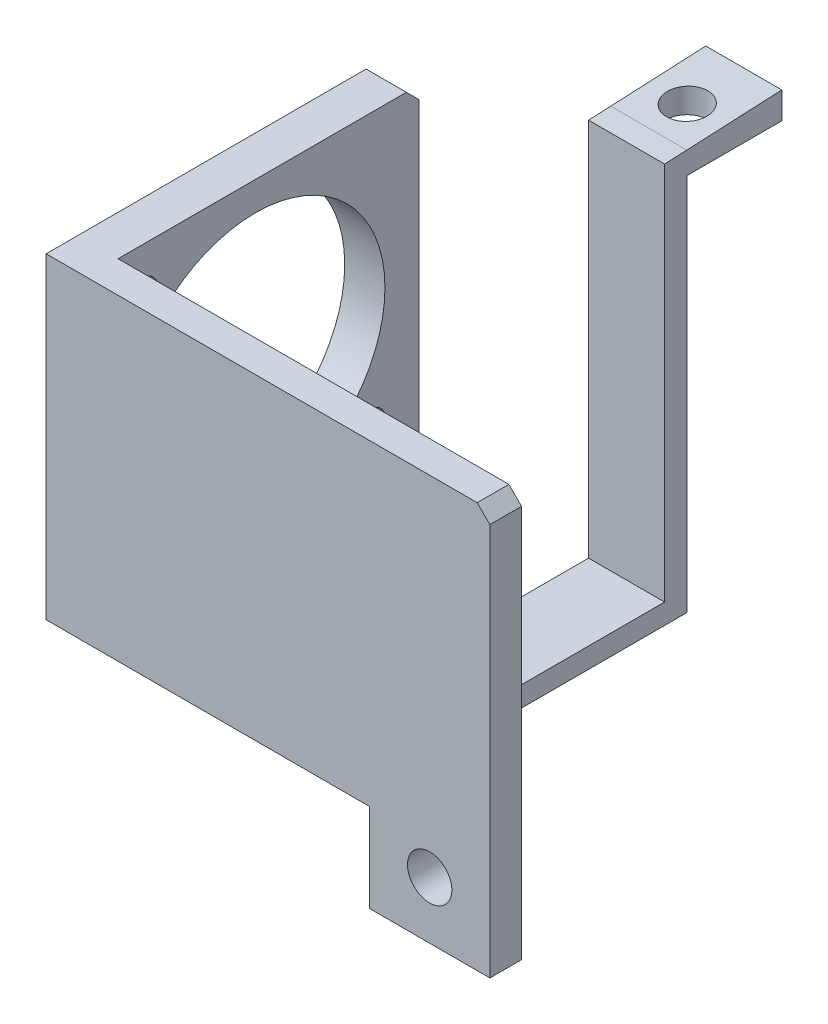
ISO-10303-21;
HEADER;
FILE_DESCRIPTION(('STEP AP214'),'2;1');
FILE_NAME('part.step','',(''),(''),'','','');
FILE_SCHEMA(('AUTOMOTIVE_DESIGN { 1 0 10303 214 1 1 1 1 }'));
ENDSEC;
DATA;
#1=APPLICATION_CONTEXT('core data for automotive mechanical design processes');
#2=APPLICATION_PROTOCOL_DEFINITION('international standard','automotive_design',2000,#1);
#3=PRODUCT_CONTEXT('',#1,'mechanical');
#4=PRODUCT('Part','Part','',(#3));
#5=PRODUCT_RELATED_PRODUCT_CATEGORY('part','',(#4));
#6=PRODUCT_DEFINITION_FORMATION('','',#4);
#7=PRODUCT_DEFINITION_CONTEXT('part definition',#1,'design');
#8=PRODUCT_DEFINITION('design','',#6,#7);
#9=PRODUCT_DEFINITION_SHAPE('','',#8);
#10=(LENGTH_UNIT() NAMED_UNIT(*) SI_UNIT(.MILLI.,.METRE.));
#11=(NAMED_UNIT(*) PLANE_ANGLE_UNIT() SI_UNIT($,.RADIAN.));
#12=(NAMED_UNIT(*) SI_UNIT($,.STERADIAN.) SOLID_ANGLE_UNIT());
#13=UNCERTAINTY_MEASURE_WITH_UNIT(LENGTH_MEASURE(1.E-05),#10,'distance_accuracy_value','');
#14=(GEOMETRIC_REPRESENTATION_CONTEXT(3) GLOBAL_UNCERTAINTY_ASSIGNED_CONTEXT((#13)) GLOBAL_UNIT_ASSIGNED_CONTEXT((#10,
#11,#12)) REPRESENTATION_CONTEXT('',''));
#15=CARTESIAN_POINT('',(0.,0.,0.));
#16=DIRECTION('',(0.,0.,1.));
#17=DIRECTION('',(1.,0.,0.));
#18=AXIS2_PLACEMENT_3D('',#15,#16,#17);
#19=CARTESIAN_POINT('',(0.,0.,-46.5));
#20=DIRECTION('',(0.,0.,1.));
#21=DIRECTION('',(1.,0.,0.));
#22=AXIS2_PLACEMENT_3D('',#19,#20,#21);
#23=PLANE('',#22);
#24=DIRECTION('',(-1.,0.,0.));
#25=VECTOR('',#24,1.);
#26=CARTESIAN_POINT('',(49.56,59.6966428528848,-46.5));
#27=LINE('',#26,#25);
#28=CARTESIAN_POINT('',(49.56,59.6966428528848,-46.5));
#29=VERTEX_POINT('',#28);
#30=CARTESIAN_POINT('',(37.56,59.6966428528848,-46.5));
#31=VERTEX_POINT('',#30);
#32=EDGE_CURVE('E483',#29,#31,#27,.T.);
#33=ORIENTED_EDGE('',*,*,#32,.F.);
#34=DIRECTION('',(0.,-1.,0.));
#35=VECTOR('',#34,1.);
#36=CARTESIAN_POINT('',(49.56,0.,-46.5));
#37=LINE('',#36,#35);
#38=CARTESIAN_POINT('',(49.56,0.,-46.5));
#39=VERTEX_POINT('',#38);
#40=EDGE_CURVE('E217',#29,#39,#37,.T.);
#41=ORIENTED_EDGE('',*,*,#40,.T.);
#42=DIRECTION('',(-1.,0.,0.));
#43=VECTOR('',#42,1.);
#44=CARTESIAN_POINT('',(49.56,0.,-46.5));
#45=LINE('',#44,#43);
#46=CARTESIAN_POINT('',(37.56,0.,-46.5));
#47=VERTEX_POINT('',#46);
#48=EDGE_CURVE('E219',#39,#47,#45,.T.);
#49=ORIENTED_EDGE('',*,*,#48,.T.);
#50=DIRECTION('',(0.,1.,0.));
#51=VECTOR('',#50,1.);
#52=CARTESIAN_POINT('',(37.56,0.,-46.5));
#53=LINE('',#52,#51);
#54=EDGE_CURVE('E222',#47,#31,#53,.T.);
#55=ORIENTED_EDGE('',*,*,#54,.T.);
#56=EDGE_LOOP('',(#33,#41,#49,#55));
#57=FACE_BOUND('',#56,.T.);
#58=ADVANCED_FACE('F37',(#57),#23,.F.);
#59=CARTESIAN_POINT('',(49.56,3.2,-46.5));
#60=DIRECTION('',(0.,-1.,0.));
#61=DIRECTION('',(0.,0.,-1.));
#62=AXIS2_PLACEMENT_3D('',#59,#60,#61);
#63=PLANE('',#62);
#64=DIRECTION('',(1.,0.,0.));
#65=VECTOR('',#64,1.);
#66=CARTESIAN_POINT('',(37.56,3.2,-43.));
#67=LINE('',#66,#65);
#68=CARTESIAN_POINT('',(37.56,3.2,-43.));
#69=VERTEX_POINT('',#68);
#70=CARTESIAN_POINT('',(49.56,3.2,-43.));
#71=VERTEX_POINT('',#70);
#72=EDGE_CURVE('E213',#69,#71,#67,.T.);
#73=ORIENTED_EDGE('',*,*,#72,.F.);
#74=DIRECTION('',(0.,0.,1.));
#75=VECTOR('',#74,1.);
#76=CARTESIAN_POINT('',(37.56,3.2,-46.5));
#77=LINE('',#76,#75);
#78=CARTESIAN_POINT('',(37.56,3.2,0.));
#79=VERTEX_POINT('',#78);
#80=EDGE_CURVE('E234',#69,#79,#77,.T.);
#81=ORIENTED_EDGE('',*,*,#80,.T.);
#82=DIRECTION('',(1.,0.,0.));
#83=VECTOR('',#82,1.);
#84=CARTESIAN_POINT('',(49.56,3.2,0.));
#85=LINE('',#84,#83);
#86=CARTESIAN_POINT('',(49.56,3.2,0.));
#87=VERTEX_POINT('',#86);
#88=EDGE_CURVE('E220',#79,#87,#85,.T.);
#89=ORIENTED_EDGE('',*,*,#88,.T.);
#90=DIRECTION('',(0.,0.,1.));
#91=VECTOR('',#90,1.);
#92=CARTESIAN_POINT('',(49.56,3.2,-46.5));
#93=LINE('',#92,#91);
#94=EDGE_CURVE('E225',#71,#87,#93,.T.);
#95=ORIENTED_EDGE('',*,*,#94,.F.);
#96=EDGE_LOOP('',(#73,#81,#89,#95));
#97=FACE_BOUND('',#96,.T.);
#98=ADVANCED_FACE('F378',(#97),#63,.F.);
#99=CARTESIAN_POINT('',(0.,0.,0.));
#100=DIRECTION('',(0.,0.,-1.));
#101=DIRECTION('',(-1.,0.,0.));
#102=AXIS2_PLACEMENT_3D('',#99,#100,#101);
#103=PLANE('',#102);
#104=CARTESIAN_POINT('',(60.5,-4.93898511090854,0.));
#105=DIRECTION('',(0.,0.,-1.));
#106=DIRECTION('',(-1.,0.,0.));
#107=AXIS2_PLACEMENT_3D('',#104,#105,#106);
#108=CIRCLE('',#107,3.5);
#109=CARTESIAN_POINT('',(57.,-4.93898511090854,0.));
#110=VERTEX_POINT('',#109);
#111=EDGE_CURVE('E240',#110,#110,#108,.T.);
#112=ORIENTED_EDGE('',*,*,#111,.F.);
#113=EDGE_LOOP('',(#112));
#114=FACE_BOUND('',#113,.T.);
#115=DIRECTION('',(-1.,0.,0.));
#116=VECTOR('',#115,1.);
#117=CARTESIAN_POINT('',(0.,50.,0.));
#118=LINE('',#117,#116);
#119=CARTESIAN_POINT('',(68.,50.,0.));
#120=VERTEX_POINT('',#119);
#121=CARTESIAN_POINT('',(6.35,50.,0.));
#122=VERTEX_POINT('',#121);
#123=EDGE_CURVE('E283',#120,#122,#118,.T.);
#124=ORIENTED_EDGE('',*,*,#123,.F.);
#125=DIRECTION('',(-0.70710678118655,0.707106781186545,0.));
#126=VECTOR('',#125,1.);
#127=CARTESIAN_POINT('',(58.9999999999998,59.0000000000002,0.));
#128=LINE('',#127,#126);
#129=CARTESIAN_POINT('',(70.,48.,0.));
#130=VERTEX_POINT('',#129);
#131=EDGE_CURVE('E324',#120,#130,#128,.F.);
#132=ORIENTED_EDGE('',*,*,#131,.T.);
#133=DIRECTION('',(0.,1.,0.));
#134=VECTOR('',#133,1.);
#135=CARTESIAN_POINT('',(70.,64.0610148890915,0.));
#136=LINE('',#135,#134);
#137=CARTESIAN_POINT('',(70.,-13.9389851109085,0.));
#138=VERTEX_POINT('',#137);
#139=EDGE_CURVE('E302',#138,#130,#136,.T.);
#140=ORIENTED_EDGE('',*,*,#139,.F.);
#141=DIRECTION('',(1.,0.,0.));
#142=VECTOR('',#141,1.);
#143=CARTESIAN_POINT('',(70.,-13.9389851109085,0.));
#144=LINE('',#143,#142);
#145=CARTESIAN_POINT('',(51.,-13.9389851109085,0.));
#146=VERTEX_POINT('',#145);
#147=EDGE_CURVE('E300',#146,#138,#144,.T.);
#148=ORIENTED_EDGE('',*,*,#147,.F.);
#149=DIRECTION('',(0.,-1.,0.));
#150=VECTOR('',#149,1.);
#151=CARTESIAN_POINT('',(51.,-13.9389851109085,0.));
#152=LINE('',#151,#150);
#153=CARTESIAN_POINT('',(51.,0.,0.));
#154=VERTEX_POINT('',#153);
#155=EDGE_CURVE('E298',#154,#146,#152,.T.);
#156=ORIENTED_EDGE('',*,*,#155,.F.);
#157=DIRECTION('',(1.,0.,0.));
#158=VECTOR('',#157,1.);
#159=CARTESIAN_POINT('',(51.,0.,0.));
#160=LINE('',#159,#158);
#161=CARTESIAN_POINT('',(49.56,0.,0.));
#162=VERTEX_POINT('',#161);
#163=EDGE_CURVE('E278',#162,#154,#160,.T.);
#164=ORIENTED_EDGE('',*,*,#163,.F.);
#165=DIRECTION('',(0.,-1.,0.));
#166=VECTOR('',#165,1.);
#167=CARTESIAN_POINT('',(49.56,0.,0.));
#168=LINE('',#167,#166);
#169=EDGE_CURVE('E186',#87,#162,#168,.T.);
#170=ORIENTED_EDGE('',*,*,#169,.F.);
#171=ORIENTED_EDGE('',*,*,#88,.F.);
#172=DIRECTION('',(0.,1.,0.));
#173=VECTOR('',#172,1.);
#174=CARTESIAN_POINT('',(37.56,0.,0.));
#175=LINE('',#174,#173);
#176=CARTESIAN_POINT('',(37.56,0.,0.));
#177=VERTEX_POINT('',#176);
#178=EDGE_CURVE('E228',#177,#79,#175,.T.);
#179=ORIENTED_EDGE('',*,*,#178,.F.);
#180=CARTESIAN_POINT('',(6.35,0.,0.));
#181=VERTEX_POINT('',#180);
#182=EDGE_CURVE('E295',#181,#177,#160,.T.);
#183=ORIENTED_EDGE('',*,*,#182,.F.);
#184=DIRECTION('',(0.,-1.,0.));
#185=VECTOR('',#184,1.);
#186=CARTESIAN_POINT('',(6.35,0.,0.));
#187=LINE('',#186,#185);
#188=EDGE_CURVE('E270',#122,#181,#187,.T.);
#189=ORIENTED_EDGE('',*,*,#188,.F.);
#190=EDGE_LOOP('',(#124,#132,#140,#148,#156,#164,#170,#171,#179,#183,#189));
#191=FACE_BOUND('',#190,.T.);
#192=ADVANCED_FACE('F359',(#114,#191),#103,.T.);
#193=CARTESIAN_POINT('',(51.,0.,5.));
#194=DIRECTION('',(0.,1.,0.));
#195=DIRECTION('',(-1.,0.,0.));
#196=AXIS2_PLACEMENT_3D('',#193,#194,#195);
#197=PLANE('',#196);
#198=DIRECTION('',(0.,0.,-1.));
#199=VECTOR('',#198,1.);
#200=CARTESIAN_POINT('',(0.,0.,5.));
#201=LINE('',#200,#199);
#202=CARTESIAN_POINT('',(0.,0.,5.));
#203=VERTEX_POINT('',#202);
#204=CARTESIAN_POINT('',(0.,0.,-45.48));
#205=VERTEX_POINT('',#204);
#206=EDGE_CURVE('E294',#203,#205,#201,.T.);
#207=ORIENTED_EDGE('',*,*,#206,.T.);
#208=DIRECTION('',(1.,0.,0.));
#209=VECTOR('',#208,1.);
#210=CARTESIAN_POINT('',(51.,0.,-45.48));
#211=LINE('',#210,#209);
#212=CARTESIAN_POINT('',(6.35,0.,-45.48));
#213=VERTEX_POINT('',#212);
#214=EDGE_CURVE('E11',#205,#213,#211,.T.);
#215=ORIENTED_EDGE('',*,*,#214,.T.);
#216=DIRECTION('',(0.,0.,1.));
#217=VECTOR('',#216,1.);
#218=CARTESIAN_POINT('',(6.35,0.,-52.48));
#219=LINE('',#218,#217);
#220=EDGE_CURVE('E273',#213,#181,#219,.T.);
#221=ORIENTED_EDGE('',*,*,#220,.T.);
#222=ORIENTED_EDGE('',*,*,#182,.T.);
#223=DIRECTION('',(0.,0.,1.));
#224=VECTOR('',#223,1.);
#225=CARTESIAN_POINT('',(37.56,0.,-46.5));
#226=LINE('',#225,#224);
#227=EDGE_CURVE('E236',#47,#177,#226,.T.);
#228=ORIENTED_EDGE('',*,*,#227,.F.);
#229=ORIENTED_EDGE('',*,*,#48,.F.);
#230=DIRECTION('',(0.,0.,1.));
#231=VECTOR('',#230,1.);
#232=CARTESIAN_POINT('',(49.56,0.,-46.5));
#233=LINE('',#232,#231);
#234=EDGE_CURVE('E238',#39,#162,#233,.T.);
#235=ORIENTED_EDGE('',*,*,#234,.T.);
#236=ORIENTED_EDGE('',*,*,#163,.T.);
#237=DIRECTION('',(0.,0.,-1.));
#238=VECTOR('',#237,1.);
#239=CARTESIAN_POINT('',(51.,0.,5.));
#240=LINE('',#239,#238);
#241=CARTESIAN_POINT('',(51.,0.,5.));
#242=VERTEX_POINT('',#241);
#243=EDGE_CURVE('E316',#242,#154,#240,.T.);
#244=ORIENTED_EDGE('',*,*,#243,.F.);
#245=DIRECTION('',(1.,0.,0.));
#246=VECTOR('',#245,1.);
#247=CARTESIAN_POINT('',(51.,0.,5.));
#248=LINE('',#247,#246);
#249=EDGE_CURVE('E279',#203,#242,#248,.T.);
#250=ORIENTED_EDGE('',*,*,#249,.F.);
#251=EDGE_LOOP('',(#207,#215,#221,#222,#228,#229,#235,#236,#244,#250));
#252=FACE_BOUND('',#251,.T.);
#253=ADVANCED_FACE('F365',(#252),#197,.F.);
#254=CARTESIAN_POINT('',(51.,-13.9389851109085,5.));
#255=DIRECTION('',(1.,0.,0.));
#256=DIRECTION('',(0.,0.,-1.));
#257=AXIS2_PLACEMENT_3D('',#254,#255,#256);
#258=PLANE('',#257);
#259=ORIENTED_EDGE('',*,*,#155,.T.);
#260=DIRECTION('',(0.,0.,-1.));
#261=VECTOR('',#260,1.);
#262=CARTESIAN_POINT('',(51.,-13.9389851109085,5.));
#263=LINE('',#262,#261);
#264=CARTESIAN_POINT('',(51.,-13.9389851109085,5.));
#265=VERTEX_POINT('',#264);
#266=EDGE_CURVE('E313',#265,#146,#263,.T.);
#267=ORIENTED_EDGE('',*,*,#266,.F.);
#268=DIRECTION('',(0.,-1.,0.));
#269=VECTOR('',#268,1.);
#270=CARTESIAN_POINT('',(51.,-13.9389851109085,5.));
#271=LINE('',#270,#269);
#272=EDGE_CURVE('E282',#242,#265,#271,.T.);
#273=ORIENTED_EDGE('',*,*,#272,.F.);
#274=ORIENTED_EDGE('',*,*,#243,.T.);
#275=EDGE_LOOP('',(#259,#267,#273,#274));
#276=FACE_BOUND('',#275,.T.);
#277=ADVANCED_FACE('F437',(#276),#258,.F.);
#278=CARTESIAN_POINT('',(70.,-13.9389851109085,5.));
#279=DIRECTION('',(0.,1.,0.));
#280=DIRECTION('',(-1.,0.,0.));
#281=AXIS2_PLACEMENT_3D('',#278,#279,#280);
#282=PLANE('',#281);
#283=ORIENTED_EDGE('',*,*,#147,.T.);
#284=DIRECTION('',(0.,0.,-1.));
#285=VECTOR('',#284,1.);
#286=CARTESIAN_POINT('',(70.,-13.9389851109085,5.));
#287=LINE('',#286,#285);
#288=CARTESIAN_POINT('',(70.,-13.9389851109085,5.));
#289=VERTEX_POINT('',#288);
#290=EDGE_CURVE('E310',#289,#138,#287,.T.);
#291=ORIENTED_EDGE('',*,*,#290,.F.);
#292=DIRECTION('',(1.,0.,0.));
#293=VECTOR('',#292,1.);
#294=CARTESIAN_POINT('',(70.,-13.9389851109085,5.));
#295=LINE('',#294,#293);
#296=EDGE_CURVE('E285',#265,#289,#295,.T.);
#297=ORIENTED_EDGE('',*,*,#296,.F.);
#298=ORIENTED_EDGE('',*,*,#266,.T.);
#299=EDGE_LOOP('',(#283,#291,#297,#298));
#300=FACE_BOUND('',#299,.T.);
#301=ADVANCED_FACE('F433',(#300),#282,.F.);
#302=CARTESIAN_POINT('',(70.,64.0610148890915,5.));
#303=DIRECTION('',(-1.,0.,0.));
#304=DIRECTION('',(0.,-1.,0.));
#305=AXIS2_PLACEMENT_3D('',#302,#303,#304);
#306=PLANE('',#305);
#307=ORIENTED_EDGE('',*,*,#139,.T.);
#308=DIRECTION('',(0.,0.,1.));
#309=VECTOR('',#308,1.);
#310=CARTESIAN_POINT('',(70.,48.,5.));
#311=LINE('',#310,#309);
#312=CARTESIAN_POINT('',(70.,48.,5.));
#313=VERTEX_POINT('',#312);
#314=EDGE_CURVE('E326',#130,#313,#311,.T.);
#315=ORIENTED_EDGE('',*,*,#314,.T.);
#316=DIRECTION('',(0.,1.,0.));
#317=VECTOR('',#316,1.);
#318=CARTESIAN_POINT('',(70.,64.0610148890915,5.));
#319=LINE('',#318,#317);
#320=EDGE_CURVE('E287',#289,#313,#319,.T.);
#321=ORIENTED_EDGE('',*,*,#320,.F.);
#322=ORIENTED_EDGE('',*,*,#290,.T.);
#323=EDGE_LOOP('',(#307,#315,#321,#322));
#324=FACE_BOUND('',#323,.T.);
#325=ADVANCED_FACE('F430',(#324),#306,.F.);
#326=CARTESIAN_POINT('',(0.,50.,5.));
#327=DIRECTION('',(0.,-1.,0.));
#328=DIRECTION('',(0.,0.,-1.));
#329=AXIS2_PLACEMENT_3D('',#326,#327,#328);
#330=PLANE('',#329);
#331=DIRECTION('',(-1.,0.,0.));
#332=VECTOR('',#331,1.);
#333=CARTESIAN_POINT('',(0.,50.,5.));
#334=LINE('',#333,#332);
#335=CARTESIAN_POINT('',(68.,50.,5.));
#336=VERTEX_POINT('',#335);
#337=CARTESIAN_POINT('',(0.,50.,5.));
#338=VERTEX_POINT('',#337);
#339=EDGE_CURVE('E290',#336,#338,#334,.T.);
#340=ORIENTED_EDGE('',*,*,#339,.F.);
#341=DIRECTION('',(0.,0.,-1.));
#342=VECTOR('',#341,1.);
#343=CARTESIAN_POINT('',(68.,50.,5.));
#344=LINE('',#343,#342);
#345=EDGE_CURVE('E321',#336,#120,#344,.T.);
#346=ORIENTED_EDGE('',*,*,#345,.T.);
#347=ORIENTED_EDGE('',*,*,#123,.T.);
#348=DIRECTION('',(0.,0.,1.));
#349=VECTOR('',#348,1.);
#350=CARTESIAN_POINT('',(6.35,50.,-52.48));
#351=LINE('',#350,#349);
#352=CARTESIAN_POINT('',(6.35,50.,-45.48));
#353=VERTEX_POINT('',#352);
#354=EDGE_CURVE('E275',#353,#122,#351,.T.);
#355=ORIENTED_EDGE('',*,*,#354,.F.);
#356=DIRECTION('',(-1.,0.,0.));
#357=VECTOR('',#356,1.);
#358=CARTESIAN_POINT('',(0.,50.,-45.48));
#359=LINE('',#358,#357);
#360=CARTESIAN_POINT('',(0.,50.,-45.48));
#361=VERTEX_POINT('',#360);
#362=EDGE_CURVE('E319',#353,#361,#359,.T.);
#363=ORIENTED_EDGE('',*,*,#362,.T.);
#364=DIRECTION('',(0.,0.,-1.));
#365=VECTOR('',#364,1.);
#366=CARTESIAN_POINT('',(0.,50.,5.));
#367=LINE('',#366,#365);
#368=EDGE_CURVE('E307',#338,#361,#367,.T.);
#369=ORIENTED_EDGE('',*,*,#368,.F.);
#370=EDGE_LOOP('',(#340,#346,#347,#355,#363,#369));
#371=FACE_BOUND('',#370,.T.);
#372=ADVANCED_FACE('F355',(#371),#330,.F.);
#373=CARTESIAN_POINT('',(0.,0.,5.));
#374=DIRECTION('',(1.,0.,0.));
#375=DIRECTION('',(0.,0.,-1.));
#376=AXIS2_PLACEMENT_3D('',#373,#374,#375);
#377=PLANE('',#376);
#378=CARTESIAN_POINT('',(0.,7.045,-39.615));
#379=DIRECTION('',(1.,0.,0.));
#380=DIRECTION('',(0.,0.,-1.));
#381=AXIS2_PLACEMENT_3D('',#378,#379,#380);
#382=CIRCLE('',#381,2.555);
#383=CARTESIAN_POINT('',(0.,7.045,-42.17));
#384=VERTEX_POINT('',#383);
#385=EDGE_CURVE('E251',#384,#384,#382,.F.);
#386=ORIENTED_EDGE('',*,*,#385,.F.);
#387=EDGE_LOOP('',(#386));
#388=FACE_BOUND('',#387,.T.);
#389=CARTESIAN_POINT('',(0.,42.955,-3.695));
#390=DIRECTION('',(1.,0.,0.));
#391=DIRECTION('',(0.,0.,-1.));
#392=AXIS2_PLACEMENT_3D('',#389,#390,#391);
#393=CIRCLE('',#392,2.555);
#394=CARTESIAN_POINT('',(0.,42.955,-6.24999999999999));
#395=VERTEX_POINT('',#394);
#396=EDGE_CURVE('E250',#395,#395,#393,.F.);
#397=ORIENTED_EDGE('',*,*,#396,.F.);
#398=EDGE_LOOP('',(#397));
#399=FACE_BOUND('',#398,.T.);
#400=CARTESIAN_POINT('',(0.,25.,-21.66));
#401=DIRECTION('',(1.,0.,0.));
#402=DIRECTION('',(0.,0.,-1.));
#403=AXIS2_PLACEMENT_3D('',#400,#401,#402);
#404=CIRCLE('',#403,20.44);
#405=CARTESIAN_POINT('',(0.,25.,-42.1));
#406=VERTEX_POINT('',#405);
#407=EDGE_CURVE('E267',#406,#406,#404,.F.);
#408=ORIENTED_EDGE('',*,*,#407,.F.);
#409=EDGE_LOOP('',(#408));
#410=FACE_BOUND('',#409,.T.);
#411=ORIENTED_EDGE('',*,*,#368,.T.);
#412=DIRECTION('',(0.,0.707106781186545,0.70710678118655));
#413=VECTOR('',#412,1.);
#414=CARTESIAN_POINT('',(0.,48.,-47.48));
#415=LINE('',#414,#413);
#416=CARTESIAN_POINT('',(0.,48.,-47.48));
#417=VERTEX_POINT('',#416);
#418=EDGE_CURVE('E46',#361,#417,#415,.F.);
#419=ORIENTED_EDGE('',*,*,#418,.T.);
#420=DIRECTION('',(0.,1.,0.));
#421=VECTOR('',#420,1.);
#422=CARTESIAN_POINT('',(0.,50.,-47.48));
#423=LINE('',#422,#421);
#424=CARTESIAN_POINT('',(0.,2.00000000000002,-47.48));
#425=VERTEX_POINT('',#424);
#426=EDGE_CURVE('E246',#425,#417,#423,.T.);
#427=ORIENTED_EDGE('',*,*,#426,.F.);
#428=DIRECTION('',(0.,0.70710678118655,-0.707106781186545));
#429=VECTOR('',#428,1.);
#430=CARTESIAN_POINT('',(0.,0.,-45.48));
#431=LINE('',#430,#429);
#432=EDGE_CURVE('E53',#425,#205,#431,.F.);
#433=ORIENTED_EDGE('',*,*,#432,.T.);
#434=ORIENTED_EDGE('',*,*,#206,.F.);
#435=DIRECTION('',(0.,-1.,0.));
#436=VECTOR('',#435,1.);
#437=CARTESIAN_POINT('',(0.,0.,5.));
#438=LINE('',#437,#436);
#439=EDGE_CURVE('E292',#338,#203,#438,.T.);
#440=ORIENTED_EDGE('',*,*,#439,.F.);
#441=EDGE_LOOP('',(#411,#419,#427,#433,#434,#440));
#442=FACE_BOUND('',#441,.T.);
#443=ADVANCED_FACE('F339',(#388,#399,#410,#442),#377,.F.);
#444=CARTESIAN_POINT('',(0.,0.,5.));
#445=DIRECTION('',(0.,0.,-1.));
#446=DIRECTION('',(-1.,0.,0.));
#447=AXIS2_PLACEMENT_3D('',#444,#445,#446);
#448=PLANE('',#447);
#449=CARTESIAN_POINT('',(60.5,-4.93898511090854,5.));
#450=DIRECTION('',(0.,0.,-1.));
#451=DIRECTION('',(-1.,0.,0.));
#452=AXIS2_PLACEMENT_3D('',#449,#450,#451);
#453=CIRCLE('',#452,3.5);
#454=CARTESIAN_POINT('',(57.,-4.93898511090854,5.));
#455=VERTEX_POINT('',#454);
#456=EDGE_CURVE('E243',#455,#455,#453,.F.);
#457=ORIENTED_EDGE('',*,*,#456,.F.);
#458=EDGE_LOOP('',(#457));
#459=FACE_BOUND('',#458,.T.);
#460=ORIENTED_EDGE('',*,*,#320,.T.);
#461=DIRECTION('',(0.70710678118655,-0.707106781186545,0.));
#462=VECTOR('',#461,1.);
#463=CARTESIAN_POINT('',(68.,50.,5.));
#464=LINE('',#463,#462);
#465=EDGE_CURVE('E328',#313,#336,#464,.F.);
#466=ORIENTED_EDGE('',*,*,#465,.T.);
#467=ORIENTED_EDGE('',*,*,#339,.T.);
#468=ORIENTED_EDGE('',*,*,#439,.T.);
#469=ORIENTED_EDGE('',*,*,#249,.T.);
#470=ORIENTED_EDGE('',*,*,#272,.T.);
#471=ORIENTED_EDGE('',*,*,#296,.T.);
#472=EDGE_LOOP('',(#460,#466,#467,#468,#469,#470,#471));
#473=FACE_BOUND('',#472,.T.);
#474=ADVANCED_FACE('F417',(#459,#473),#448,.F.);
#475=CARTESIAN_POINT('',(6.35,0.,-52.48));
#476=DIRECTION('',(-1.,0.,0.));
#477=DIRECTION('',(0.,0.,1.));
#478=AXIS2_PLACEMENT_3D('',#475,#476,#477);
#479=PLANE('',#478);
#480=CARTESIAN_POINT('',(6.35,7.045,-39.615));
#481=DIRECTION('',(1.,0.,0.));
#482=DIRECTION('',(0.,0.,-1.));
#483=AXIS2_PLACEMENT_3D('',#480,#481,#482);
#484=CIRCLE('',#483,2.555);
#485=CARTESIAN_POINT('',(6.35,7.045,-42.17));
#486=VERTEX_POINT('',#485);
#487=EDGE_CURVE('E255',#486,#486,#484,.T.);
#488=ORIENTED_EDGE('',*,*,#487,.F.);
#489=EDGE_LOOP('',(#488));
#490=FACE_BOUND('',#489,.T.);
#491=CARTESIAN_POINT('',(6.35,42.955,-3.695));
#492=DIRECTION('',(1.,0.,0.));
#493=DIRECTION('',(0.,0.,-1.));
#494=AXIS2_PLACEMENT_3D('',#491,#492,#493);
#495=CIRCLE('',#494,2.555);
#496=CARTESIAN_POINT('',(6.35,42.955,-6.24999999999999));
#497=VERTEX_POINT('',#496);
#498=EDGE_CURVE('E247',#497,#497,#495,.T.);
#499=ORIENTED_EDGE('',*,*,#498,.F.);
#500=EDGE_LOOP('',(#499));
#501=FACE_BOUND('',#500,.T.);
#502=CARTESIAN_POINT('',(6.35,25.,-21.66));
#503=DIRECTION('',(1.,0.,0.));
#504=DIRECTION('',(0.,0.,-1.));
#505=AXIS2_PLACEMENT_3D('',#502,#503,#504);
#506=CIRCLE('',#505,20.44);
#507=CARTESIAN_POINT('',(6.35,25.,-42.1));
#508=VERTEX_POINT('',#507);
#509=EDGE_CURVE('E254',#508,#508,#506,.T.);
#510=ORIENTED_EDGE('',*,*,#509,.F.);
#511=EDGE_LOOP('',(#510));
#512=FACE_BOUND('',#511,.T.);
#513=DIRECTION('',(0.,-1.,0.));
#514=VECTOR('',#513,1.);
#515=CARTESIAN_POINT('',(6.35,50.,-47.48));
#516=LINE('',#515,#514);
#517=CARTESIAN_POINT('',(6.35,48.,-47.48));
#518=VERTEX_POINT('',#517);
#519=CARTESIAN_POINT('',(6.35,2.00000000000002,-47.48));
#520=VERTEX_POINT('',#519);
#521=EDGE_CURVE('E258',#518,#520,#516,.T.);
#522=ORIENTED_EDGE('',*,*,#521,.F.);
#523=DIRECTION('',(0.,-0.707106781186545,-0.70710678118655));
#524=VECTOR('',#523,1.);
#525=CARTESIAN_POINT('',(6.35,48.,-47.48));
#526=LINE('',#525,#524);
#527=EDGE_CURVE('E336',#518,#353,#526,.F.);
#528=ORIENTED_EDGE('',*,*,#527,.T.);
#529=ORIENTED_EDGE('',*,*,#354,.T.);
#530=ORIENTED_EDGE('',*,*,#188,.T.);
#531=ORIENTED_EDGE('',*,*,#220,.F.);
#532=DIRECTION('',(0.,-0.70710678118655,0.707106781186545));
#533=VECTOR('',#532,1.);
#534=CARTESIAN_POINT('',(6.35,0.,-45.48));
#535=LINE('',#534,#533);
#536=EDGE_CURVE('E61',#213,#520,#535,.F.);
#537=ORIENTED_EDGE('',*,*,#536,.T.);
#538=EDGE_LOOP('',(#522,#528,#529,#530,#531,#537));
#539=FACE_BOUND('',#538,.T.);
#540=ADVANCED_FACE('F351',(#490,#501,#512,#539),#479,.F.);
#541=CARTESIAN_POINT('',(-0.00100000000000013,25.,-21.66));
#542=DIRECTION('',(1.,0.,0.));
#543=DIRECTION('',(0.,0.,-1.));
#544=AXIS2_PLACEMENT_3D('',#541,#542,#543);
#545=CYLINDRICAL_SURFACE('',#544,20.44);
#546=ORIENTED_EDGE('',*,*,#509,.T.);
#547=EDGE_LOOP('',(#546));
#548=FACE_BOUND('',#547,.T.);
#549=ORIENTED_EDGE('',*,*,#407,.T.);
#550=EDGE_LOOP('',(#549));
#551=FACE_BOUND('',#550,.T.);
#552=ADVANCED_FACE('F405',(#548,#551),#545,.F.);
#553=CARTESIAN_POINT('',(-0.00100000000000013,42.955,-3.695));
#554=DIRECTION('',(1.,0.,0.));
#555=DIRECTION('',(0.,0.,-1.));
#556=AXIS2_PLACEMENT_3D('',#553,#554,#555);
#557=CYLINDRICAL_SURFACE('',#556,2.555);
#558=ORIENTED_EDGE('',*,*,#498,.T.);
#559=EDGE_LOOP('',(#558));
#560=FACE_BOUND('',#559,.T.);
#561=ORIENTED_EDGE('',*,*,#396,.T.);
#562=EDGE_LOOP('',(#561));
#563=FACE_BOUND('',#562,.T.);
#564=ADVANCED_FACE('F401',(#560,#563),#557,.F.);
#565=CARTESIAN_POINT('',(-0.00100000000000013,7.045,-39.615));
#566=DIRECTION('',(1.,0.,0.));
#567=DIRECTION('',(0.,0.,-1.));
#568=AXIS2_PLACEMENT_3D('',#565,#566,#567);
#569=CYLINDRICAL_SURFACE('',#568,2.555);
#570=ORIENTED_EDGE('',*,*,#487,.T.);
#571=EDGE_LOOP('',(#570));
#572=FACE_BOUND('',#571,.T.);
#573=ORIENTED_EDGE('',*,*,#385,.T.);
#574=EDGE_LOOP('',(#573));
#575=FACE_BOUND('',#574,.T.);
#576=ADVANCED_FACE('F404',(#572,#575),#569,.F.);
#577=CARTESIAN_POINT('',(-0.00100000000000013,50.,-47.48));
#578=DIRECTION('',(0.,0.,1.));
#579=DIRECTION('',(0.,-1.,0.));
#580=AXIS2_PLACEMENT_3D('',#577,#578,#579);
#581=PLANE('',#580);
#582=ORIENTED_EDGE('',*,*,#426,.T.);
#583=DIRECTION('',(1.,0.,0.));
#584=VECTOR('',#583,1.);
#585=CARTESIAN_POINT('',(-0.00100000000000013,48.,-47.48));
#586=LINE('',#585,#584);
#587=EDGE_CURVE('E332',#417,#518,#586,.T.);
#588=ORIENTED_EDGE('',*,*,#587,.T.);
#589=ORIENTED_EDGE('',*,*,#521,.T.);
#590=DIRECTION('',(-1.,0.,0.));
#591=VECTOR('',#590,1.);
#592=CARTESIAN_POINT('',(-0.00100000000000145,2.00000000000002,-47.48));
#593=LINE('',#592,#591);
#594=EDGE_CURVE('E330',#520,#425,#593,.T.);
#595=ORIENTED_EDGE('',*,*,#594,.T.);
#596=EDGE_LOOP('',(#582,#588,#589,#595));
#597=FACE_BOUND('',#596,.T.);
#598=ADVANCED_FACE('F346',(#597),#581,.F.);
#599=CARTESIAN_POINT('',(60.5,-4.93898511090854,5.001));
#600=DIRECTION('',(0.,0.,-1.));
#601=DIRECTION('',(-1.,0.,0.));
#602=AXIS2_PLACEMENT_3D('',#599,#600,#601);
#603=CYLINDRICAL_SURFACE('',#602,3.5);
#604=ORIENTED_EDGE('',*,*,#111,.T.);
#605=EDGE_LOOP('',(#604));
#606=FACE_BOUND('',#605,.T.);
#607=ORIENTED_EDGE('',*,*,#456,.T.);
#608=EDGE_LOOP('',(#607));
#609=FACE_BOUND('',#608,.T.);
#610=ADVANCED_FACE('F397',(#606,#609),#603,.F.);
#611=CARTESIAN_POINT('',(49.56,0.,-46.5));
#612=DIRECTION('',(-1.,0.,0.));
#613=DIRECTION('',(0.,-1.,0.));
#614=AXIS2_PLACEMENT_3D('',#611,#612,#613);
#615=PLANE('',#614);
#616=DIRECTION('',(0.,-1.,0.));
#617=VECTOR('',#616,1.);
#618=CARTESIAN_POINT('',(49.56,63.1966428528848,-61.5));
#619=LINE('',#618,#617);
#620=CARTESIAN_POINT('',(49.56,63.9166428528848,-61.5));
#621=VERTEX_POINT('',#620);
#622=CARTESIAN_POINT('',(49.56,59.6966428528848,-61.5));
#623=VERTEX_POINT('',#622);
#624=EDGE_CURVE('E196',#621,#623,#619,.T.);
#625=ORIENTED_EDGE('',*,*,#624,.F.);
#626=DIRECTION('',(0.,0.0479447993683981,-0.99884998684163));
#627=VECTOR('',#626,1.);
#628=CARTESIAN_POINT('',(49.5600000000001,63.1966428528848,-46.5));
#629=LINE('',#628,#627);
#630=CARTESIAN_POINT('',(49.5600000000001,63.1966428528848,-46.5));
#631=VERTEX_POINT('',#630);
#632=EDGE_CURVE('E179',#631,#621,#629,.T.);
#633=ORIENTED_EDGE('',*,*,#632,.F.);
#634=DIRECTION('',(0.,0.044132479785462,-0.999025687471541));
#635=VECTOR('',#634,1.);
#636=CARTESIAN_POINT('',(49.56,63.2208501025982,-47.0479788220425));
#637=LINE('',#636,#635);
#638=CARTESIAN_POINT('',(49.56,63.0420285309648,-43.));
#639=VERTEX_POINT('',#638);
#640=EDGE_CURVE('E192',#639,#631,#637,.T.);
#641=ORIENTED_EDGE('',*,*,#640,.F.);
#642=DIRECTION('',(0.,-1.,0.));
#643=VECTOR('',#642,1.);
#644=CARTESIAN_POINT('',(49.56,75.6254310840446,-43.));
#645=LINE('',#644,#643);
#646=EDGE_CURVE('E206',#639,#71,#645,.T.);
#647=ORIENTED_EDGE('',*,*,#646,.T.);
#648=ORIENTED_EDGE('',*,*,#94,.T.);
#649=ORIENTED_EDGE('',*,*,#169,.T.);
#650=ORIENTED_EDGE('',*,*,#234,.F.);
#651=ORIENTED_EDGE('',*,*,#40,.F.);
#652=DIRECTION('',(0.,0.,1.));
#653=VECTOR('',#652,1.);
#654=CARTESIAN_POINT('',(49.56,59.6966428528848,-61.5));
#655=LINE('',#654,#653);
#656=EDGE_CURVE('E209',#623,#29,#655,.T.);
#657=ORIENTED_EDGE('',*,*,#656,.F.);
#658=EDGE_LOOP('',(#625,#633,#641,#647,#648,#649,#650,#651,#657));
#659=FACE_BOUND('',#658,.T.);
#660=ADVANCED_FACE('F191',(#659),#615,.F.);
#661=CARTESIAN_POINT('',(37.56,0.,-46.5));
#662=DIRECTION('',(1.,0.,0.));
#663=DIRECTION('',(0.,0.,-1.));
#664=AXIS2_PLACEMENT_3D('',#661,#662,#663);
#665=PLANE('',#664);
#666=DIRECTION('',(0.,-0.044132479785462,0.999025687471541));
#667=VECTOR('',#666,1.);
#668=CARTESIAN_POINT('',(37.56,63.2208501025982,-47.0479788220425));
#669=LINE('',#668,#667);
#670=CARTESIAN_POINT('',(37.56,63.1966428528849,-46.5));
#671=VERTEX_POINT('',#670);
#672=CARTESIAN_POINT('',(37.56,63.0420285309648,-43.));
#673=VERTEX_POINT('',#672);
#674=EDGE_CURVE('E187',#671,#673,#669,.T.);
#675=ORIENTED_EDGE('',*,*,#674,.F.);
#676=DIRECTION('',(0.,-0.0479447993683981,0.99884998684163));
#677=VECTOR('',#676,1.);
#678=CARTESIAN_POINT('',(37.56,63.1966428528849,-46.5));
#679=LINE('',#678,#677);
#680=CARTESIAN_POINT('',(37.56,63.9166428528849,-61.5));
#681=VERTEX_POINT('',#680);
#682=EDGE_CURVE('E182',#681,#671,#679,.T.);
#683=ORIENTED_EDGE('',*,*,#682,.F.);
#684=DIRECTION('',(0.,1.,0.));
#685=VECTOR('',#684,1.);
#686=CARTESIAN_POINT('',(37.56,63.1966428528848,-61.5));
#687=LINE('',#686,#685);
#688=CARTESIAN_POINT('',(37.56,59.6966428528848,-61.5));
#689=VERTEX_POINT('',#688);
#690=EDGE_CURVE('E486',#689,#681,#687,.T.);
#691=ORIENTED_EDGE('',*,*,#690,.F.);
#692=DIRECTION('',(0.,0.,1.));
#693=VECTOR('',#692,1.);
#694=CARTESIAN_POINT('',(37.56,59.6966428528848,-61.5));
#695=LINE('',#694,#693);
#696=EDGE_CURVE('E485',#689,#31,#695,.T.);
#697=ORIENTED_EDGE('',*,*,#696,.T.);
#698=ORIENTED_EDGE('',*,*,#54,.F.);
#699=ORIENTED_EDGE('',*,*,#227,.T.);
#700=ORIENTED_EDGE('',*,*,#178,.T.);
#701=ORIENTED_EDGE('',*,*,#80,.F.);
#702=DIRECTION('',(0.,-1.,0.));
#703=VECTOR('',#702,1.);
#704=CARTESIAN_POINT('',(37.56,75.6254310840446,-43.));
#705=LINE('',#704,#703);
#706=EDGE_CURVE('E203',#673,#69,#705,.T.);
#707=ORIENTED_EDGE('',*,*,#706,.F.);
#708=EDGE_LOOP('',(#675,#683,#691,#697,#698,#699,#700,#701,#707));
#709=FACE_BOUND('',#708,.T.);
#710=ADVANCED_FACE('F391',(#709),#665,.F.);
#711=CARTESIAN_POINT('',(37.56,75.6254310840446,-43.));
#712=DIRECTION('',(0.,0.,-1.));
#713=DIRECTION('',(-1.,0.,0.));
#714=AXIS2_PLACEMENT_3D('',#711,#712,#713);
#715=PLANE('',#714);
#716=DIRECTION('',(1.,0.,0.));
#717=VECTOR('',#716,1.);
#718=CARTESIAN_POINT('',(37.56,63.0420285309648,-43.));
#719=LINE('',#718,#717);
#720=EDGE_CURVE('E202',#673,#639,#719,.T.);
#721=ORIENTED_EDGE('',*,*,#720,.F.);
#722=ORIENTED_EDGE('',*,*,#706,.T.);
#723=ORIENTED_EDGE('',*,*,#72,.T.);
#724=ORIENTED_EDGE('',*,*,#646,.F.);
#725=EDGE_LOOP('',(#721,#722,#723,#724));
#726=FACE_BOUND('',#725,.T.);
#727=ADVANCED_FACE('F388',(#726),#715,.F.);
#728=CARTESIAN_POINT('',(166.832994776385,64.0854351331042,-66.6195655236647));
#729=DIRECTION('',(0.,0.999025687471541,0.044132479785462));
#730=DIRECTION('',(0.,-0.044132479785462,0.999025687471541));
#731=AXIS2_PLACEMENT_3D('',#728,#729,#730);
#732=PLANE('',#731);
#733=ORIENTED_EDGE('',*,*,#674,.T.);
#734=ORIENTED_EDGE('',*,*,#720,.T.);
#735=ORIENTED_EDGE('',*,*,#640,.T.);
#736=DIRECTION('',(-1.,0.,0.));
#737=VECTOR('',#736,1.);
#738=CARTESIAN_POINT('',(37.56,63.1966428528848,-46.5));
#739=LINE('',#738,#737);
#740=EDGE_CURVE('E176',#631,#671,#739,.T.);
#741=ORIENTED_EDGE('',*,*,#740,.T.);
#742=EDGE_LOOP('',(#733,#734,#735,#741));
#743=FACE_BOUND('',#742,.T.);
#744=ADVANCED_FACE('F200',(#743),#732,.T.);
#745=CARTESIAN_POINT('',(49.56,59.6966428528848,-61.5));
#746=DIRECTION('',(0.,1.,0.));
#747=DIRECTION('',(0.,0.,1.));
#748=AXIS2_PLACEMENT_3D('',#745,#746,#747);
#749=PLANE('',#748);
#750=CARTESIAN_POINT('',(43.56,59.6966428528848,-52.57));
#751=DIRECTION('',(0.,-1.,0.));
#752=DIRECTION('',(0.,0.,-1.));
#753=AXIS2_PLACEMENT_3D('',#750,#751,#752);
#754=CIRCLE('',#753,3.25);
#755=CARTESIAN_POINT('',(43.56,59.6966428528848,-55.82));
#756=VERTEX_POINT('',#755);
#757=EDGE_CURVE('E501',#756,#756,#754,.T.);
#758=ORIENTED_EDGE('',*,*,#757,.F.);
#759=EDGE_LOOP('',(#758));
#760=FACE_BOUND('',#759,.T.);
#761=ORIENTED_EDGE('',*,*,#32,.T.);
#762=ORIENTED_EDGE('',*,*,#696,.F.);
#763=DIRECTION('',(-1.,0.,0.));
#764=VECTOR('',#763,1.);
#765=CARTESIAN_POINT('',(49.56,59.6966428528848,-61.5));
#766=LINE('',#765,#764);
#767=EDGE_CURVE('E490',#623,#689,#766,.T.);
#768=ORIENTED_EDGE('',*,*,#767,.F.);
#769=ORIENTED_EDGE('',*,*,#656,.T.);
#770=EDGE_LOOP('',(#761,#762,#768,#769));
#771=FACE_BOUND('',#770,.T.);
#772=ADVANCED_FACE('F458',(#760,#771),#749,.F.);
#773=CARTESIAN_POINT('',(0.,0.,-61.5));
#774=DIRECTION('',(0.,0.,-1.));
#775=DIRECTION('',(-1.,0.,0.));
#776=AXIS2_PLACEMENT_3D('',#773,#774,#775);
#777=PLANE('',#776);
#778=ORIENTED_EDGE('',*,*,#624,.T.);
#779=ORIENTED_EDGE('',*,*,#767,.T.);
#780=ORIENTED_EDGE('',*,*,#690,.T.);
#781=DIRECTION('',(-1.,0.,0.));
#782=VECTOR('',#781,1.);
#783=CARTESIAN_POINT('',(37.56,63.9166428528848,-61.5));
#784=LINE('',#783,#782);
#785=EDGE_CURVE('E198',#621,#681,#784,.T.);
#786=ORIENTED_EDGE('',*,*,#785,.F.);
#787=EDGE_LOOP('',(#778,#779,#780,#786));
#788=FACE_BOUND('',#787,.T.);
#789=ADVANCED_FACE('F449',(#788),#777,.T.);
#790=CARTESIAN_POINT('',(68.,50.,5.));
#791=DIRECTION('',(-0.707106781186545,-0.70710678118655,0.));
#792=DIRECTION('',(0.,0.,-1.));
#793=AXIS2_PLACEMENT_3D('',#790,#791,#792);
#794=PLANE('',#793);
#795=ORIENTED_EDGE('',*,*,#465,.F.);
#796=ORIENTED_EDGE('',*,*,#314,.F.);
#797=ORIENTED_EDGE('',*,*,#131,.F.);
#798=ORIENTED_EDGE('',*,*,#345,.F.);
#799=EDGE_LOOP('',(#795,#796,#797,#798));
#800=FACE_BOUND('',#799,.T.);
#801=ADVANCED_FACE('F376',(#800),#794,.F.);
#802=CARTESIAN_POINT('',(-0.00100000000000013,48.,-47.48));
#803=DIRECTION('',(0.,-0.70710678118655,0.707106781186545));
#804=DIRECTION('',(1.,0.,0.));
#805=AXIS2_PLACEMENT_3D('',#802,#803,#804);
#806=PLANE('',#805);
#807=ORIENTED_EDGE('',*,*,#418,.F.);
#808=ORIENTED_EDGE('',*,*,#362,.F.);
#809=ORIENTED_EDGE('',*,*,#527,.F.);
#810=ORIENTED_EDGE('',*,*,#587,.F.);
#811=EDGE_LOOP('',(#807,#808,#809,#810));
#812=FACE_BOUND('',#811,.T.);
#813=ADVANCED_FACE('F348',(#812),#806,.F.);
#814=CARTESIAN_POINT('',(51.,0.,-45.48));
#815=DIRECTION('',(0.,0.707106781186545,0.70710678118655));
#816=DIRECTION('',(1.,0.,0.));
#817=AXIS2_PLACEMENT_3D('',#814,#815,#816);
#818=PLANE('',#817);
#819=ORIENTED_EDGE('',*,*,#432,.F.);
#820=ORIENTED_EDGE('',*,*,#594,.F.);
#821=ORIENTED_EDGE('',*,*,#536,.F.);
#822=ORIENTED_EDGE('',*,*,#214,.F.);
#823=EDGE_LOOP('',(#819,#820,#821,#822));
#824=FACE_BOUND('',#823,.T.);
#825=ADVANCED_FACE('F40',(#824),#818,.F.);
#826=CARTESIAN_POINT('',(-0.001000000000001,63.196642852885,-46.5));
#827=DIRECTION('',(0.,-0.99884998684163,-0.0479447993683981));
#828=DIRECTION('',(0.,0.0479447993683981,-0.99884998684163));
#829=AXIS2_PLACEMENT_3D('',#826,#827,#828);
#830=PLANE('',#829);
#831=CARTESIAN_POINT('',(43.56,63.4880028528849,-52.57));
#832=DIRECTION('',(0.,-0.99884998684163,-0.0479447993683981));
#833=DIRECTION('',(0.,-0.0479447993683981,0.99884998684163));
#834=AXIS2_PLACEMENT_3D('',#831,#832,#833);
#835=ELLIPSE('',#834,3.25374184593677,3.25);
#836=CARTESIAN_POINT('',(43.5600000000001,63.3320028528849,-49.32));
#837=VERTEX_POINT('',#836);
#838=EDGE_CURVE('E498',#837,#837,#835,.F.);
#839=ORIENTED_EDGE('',*,*,#838,.F.);
#840=EDGE_LOOP('',(#839));
#841=FACE_BOUND('',#840,.T.);
#842=ORIENTED_EDGE('',*,*,#682,.T.);
#843=ORIENTED_EDGE('',*,*,#740,.F.);
#844=ORIENTED_EDGE('',*,*,#632,.T.);
#845=ORIENTED_EDGE('',*,*,#785,.T.);
#846=EDGE_LOOP('',(#842,#843,#844,#845));
#847=FACE_BOUND('',#846,.T.);
#848=ADVANCED_FACE('F178',(#841,#847),#830,.F.);
#849=CARTESIAN_POINT('',(43.56,63.9176428528849,-52.57));
#850=DIRECTION('',(0.,-1.,0.));
#851=DIRECTION('',(0.,0.,-1.));
#852=AXIS2_PLACEMENT_3D('',#849,#850,#851);
#853=CYLINDRICAL_SURFACE('',#852,3.25);
#854=ORIENTED_EDGE('',*,*,#757,.T.);
#855=EDGE_LOOP('',(#854));
#856=FACE_BOUND('',#855,.T.);
#857=ORIENTED_EDGE('',*,*,#838,.T.);
#858=EDGE_LOOP('',(#857));
#859=FACE_BOUND('',#858,.T.);
#860=ADVANCED_FACE('F373',(#856,#859),#853,.F.);
#861=CLOSED_SHELL('',(#58,#98,#192,#253,#277,#301,#325,#372,#443,#474,#540,#552,#564,#576,#598,
#610,#660,#710,#727,#744,#772,#789,#801,#813,#825,#848,#860));
#862=MANIFOLD_SOLID_BREP('B2',#861);
#863=ADVANCED_BREP_SHAPE_REPRESENTATION('',(#18,#862),#14);
#864=SHAPE_DEFINITION_REPRESENTATION(#9,#863);
ENDSEC;
END-ISO-10303-21;
